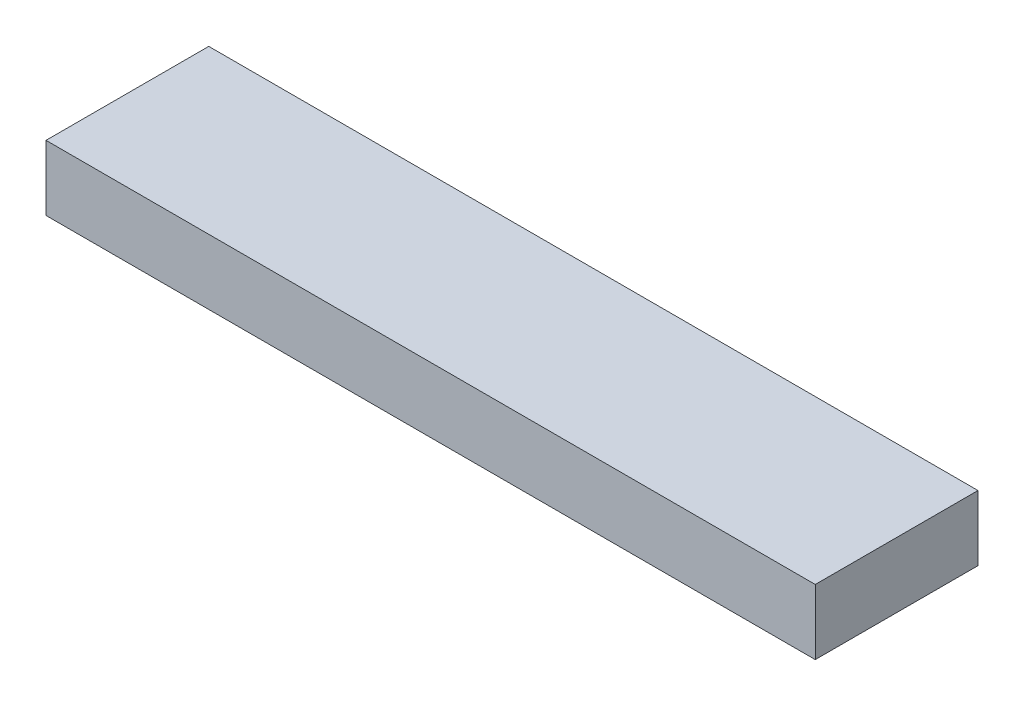
ISO-10303-21;
HEADER;
FILE_DESCRIPTION(('STEP AP214'),'2;1');
FILE_NAME('part.step','',(''),(''),'','','');
FILE_SCHEMA(('AUTOMOTIVE_DESIGN { 1 0 10303 214 1 1 1 1 }'));
ENDSEC;
DATA;
#1=APPLICATION_CONTEXT('core data for automotive mechanical design processes');
#2=APPLICATION_PROTOCOL_DEFINITION('international standard','automotive_design',2000,#1);
#3=PRODUCT_CONTEXT('',#1,'mechanical');
#4=PRODUCT('Part','Part','',(#3));
#5=PRODUCT_RELATED_PRODUCT_CATEGORY('part','',(#4));
#6=PRODUCT_DEFINITION_FORMATION('','',#4);
#7=PRODUCT_DEFINITION_CONTEXT('part definition',#1,'design');
#8=PRODUCT_DEFINITION('design','',#6,#7);
#9=PRODUCT_DEFINITION_SHAPE('','',#8);
#10=(LENGTH_UNIT() NAMED_UNIT(*) SI_UNIT(.MILLI.,.METRE.));
#11=(NAMED_UNIT(*) PLANE_ANGLE_UNIT() SI_UNIT($,.RADIAN.));
#12=(NAMED_UNIT(*) SI_UNIT($,.STERADIAN.) SOLID_ANGLE_UNIT());
#13=UNCERTAINTY_MEASURE_WITH_UNIT(LENGTH_MEASURE(1.E-05),#10,'distance_accuracy_value','');
#14=(GEOMETRIC_REPRESENTATION_CONTEXT(3) GLOBAL_UNCERTAINTY_ASSIGNED_CONTEXT((#13)) GLOBAL_UNIT_ASSIGNED_CONTEXT((#10,
#11,#12)) REPRESENTATION_CONTEXT('',''));
#15=CARTESIAN_POINT('',(0.,0.,0.));
#16=DIRECTION('',(0.,0.,1.));
#17=DIRECTION('',(1.,0.,0.));
#18=AXIS2_PLACEMENT_3D('',#15,#16,#17);
#19=CARTESIAN_POINT('',(0.,6.79999999999999,0.));
#20=DIRECTION('',(0.,-1.,0.));
#21=DIRECTION('',(0.,0.,-1.));
#22=AXIS2_PLACEMENT_3D('',#19,#20,#21);
#23=PLANE('',#22);
#24=DIRECTION('',(0.,0.,1.));
#25=VECTOR('',#24,1.);
#26=CARTESIAN_POINT('',(28.759347554151,6.8,11.7546737770755));
#27=LINE('',#26,#25);
#28=CARTESIAN_POINT('',(28.759347554151,6.8,4.25467377707552));
#29=VERTEX_POINT('',#28);
#30=CARTESIAN_POINT('',(28.759347554151,6.80000000000002,11.7546737770755));
#31=VERTEX_POINT('',#30);
#32=EDGE_CURVE('E55',#29,#31,#27,.T.);
#33=ORIENTED_EDGE('',*,*,#32,.T.);
#34=DIRECTION('',(1.,0.,0.));
#35=VECTOR('',#34,1.);
#36=CARTESIAN_POINT('',(-6.69065244584897,6.80000000000003,11.7546737770755));
#37=LINE('',#36,#35);
#38=CARTESIAN_POINT('',(-6.69065244584897,6.80000000000003,11.7546737770755));
#39=VERTEX_POINT('',#38);
#40=EDGE_CURVE('E76',#31,#39,#37,.F.);
#41=ORIENTED_EDGE('',*,*,#40,.T.);
#42=DIRECTION('',(0.,0.,-1.));
#43=VECTOR('',#42,1.);
#44=CARTESIAN_POINT('',(-6.69065244584897,6.80000000000003,11.7546737770755));
#45=LINE('',#44,#43);
#46=CARTESIAN_POINT('',(-6.69065244584897,6.80000000000001,4.25467377707552));
#47=VERTEX_POINT('',#46);
#48=EDGE_CURVE('E58',#39,#47,#45,.T.);
#49=ORIENTED_EDGE('',*,*,#48,.T.);
#50=DIRECTION('',(1.,0.,0.));
#51=VECTOR('',#50,1.);
#52=CARTESIAN_POINT('',(-6.69065244584897,6.8,4.25467377707552));
#53=LINE('',#52,#51);
#54=EDGE_CURVE('E20',#47,#29,#53,.T.);
#55=ORIENTED_EDGE('',*,*,#54,.T.);
#56=EDGE_LOOP('',(#33,#41,#49,#55));
#57=FACE_BOUND('',#56,.T.);
#58=ADVANCED_FACE('F17',(#57),#23,.T.);
#59=CARTESIAN_POINT('',(-6.69065244584897,9.8,4.25467377707551));
#60=DIRECTION('',(0.,0.,1.));
#61=DIRECTION('',(0.,-1.,0.));
#62=AXIS2_PLACEMENT_3D('',#59,#60,#61);
#63=PLANE('',#62);
#64=DIRECTION('',(0.,1.,0.));
#65=VECTOR('',#64,1.);
#66=CARTESIAN_POINT('',(-6.69065244584897,9.80000000000003,4.25467377707552));
#67=LINE('',#66,#65);
#68=CARTESIAN_POINT('',(-6.69065244584897,9.8,4.25467377707551));
#69=VERTEX_POINT('',#68);
#70=EDGE_CURVE('E78',#47,#69,#67,.T.);
#71=ORIENTED_EDGE('',*,*,#70,.T.);
#72=DIRECTION('',(1.,0.,0.));
#73=VECTOR('',#72,1.);
#74=CARTESIAN_POINT('',(0.,9.8,4.25467377707551));
#75=LINE('',#74,#73);
#76=CARTESIAN_POINT('',(28.759347554151,9.80000000000001,4.25467377707551));
#77=VERTEX_POINT('',#76);
#78=EDGE_CURVE('E73',#69,#77,#75,.T.);
#79=ORIENTED_EDGE('',*,*,#78,.T.);
#80=DIRECTION('',(0.,1.,0.));
#81=VECTOR('',#80,1.);
#82=CARTESIAN_POINT('',(28.759347554151,9.80000000000003,4.25467377707551));
#83=LINE('',#82,#81);
#84=EDGE_CURVE('E63',#77,#29,#83,.F.);
#85=ORIENTED_EDGE('',*,*,#84,.T.);
#86=ORIENTED_EDGE('',*,*,#54,.F.);
#87=EDGE_LOOP('',(#71,#79,#85,#86));
#88=FACE_BOUND('',#87,.T.);
#89=ADVANCED_FACE('F72',(#88),#63,.F.);
#90=CARTESIAN_POINT('',(28.759347554151,9.80000000000003,11.7546737770755));
#91=DIRECTION('',(-1.,0.,0.));
#92=DIRECTION('',(0.,0.,1.));
#93=AXIS2_PLACEMENT_3D('',#90,#91,#92);
#94=PLANE('',#93);
#95=ORIENTED_EDGE('',*,*,#84,.F.);
#96=DIRECTION('',(0.,0.,-1.));
#97=VECTOR('',#96,1.);
#98=CARTESIAN_POINT('',(28.759347554151,9.79999999999999,0.));
#99=LINE('',#98,#97);
#100=CARTESIAN_POINT('',(28.759347554151,9.80000000000003,11.7546737770755));
#101=VERTEX_POINT('',#100);
#102=EDGE_CURVE('E83',#77,#101,#99,.F.);
#103=ORIENTED_EDGE('',*,*,#102,.T.);
#104=DIRECTION('',(0.,1.,0.));
#105=VECTOR('',#104,1.);
#106=CARTESIAN_POINT('',(28.759347554151,9.80000000000003,11.7546737770755));
#107=LINE('',#106,#105);
#108=EDGE_CURVE('E69',#101,#31,#107,.F.);
#109=ORIENTED_EDGE('',*,*,#108,.T.);
#110=ORIENTED_EDGE('',*,*,#32,.F.);
#111=EDGE_LOOP('',(#95,#103,#109,#110));
#112=FACE_BOUND('',#111,.T.);
#113=ADVANCED_FACE('F66',(#112),#94,.F.);
#114=CARTESIAN_POINT('',(-6.69065244584897,9.80000000000003,11.7546737770755));
#115=DIRECTION('',(0.,0.,-1.));
#116=DIRECTION('',(0.,1.,0.));
#117=AXIS2_PLACEMENT_3D('',#114,#115,#116);
#118=PLANE('',#117);
#119=ORIENTED_EDGE('',*,*,#40,.F.);
#120=ORIENTED_EDGE('',*,*,#108,.F.);
#121=DIRECTION('',(1.,0.,0.));
#122=VECTOR('',#121,1.);
#123=CARTESIAN_POINT('',(0.,9.80000000000003,11.7546737770755));
#124=LINE('',#123,#122);
#125=CARTESIAN_POINT('',(-6.69065244584897,9.80000000000002,11.7546737770755));
#126=VERTEX_POINT('',#125);
#127=EDGE_CURVE('E26',#101,#126,#124,.F.);
#128=ORIENTED_EDGE('',*,*,#127,.T.);
#129=DIRECTION('',(0.,1.,0.));
#130=VECTOR('',#129,1.);
#131=CARTESIAN_POINT('',(-6.69065244584897,9.80000000000003,11.7546737770755));
#132=LINE('',#131,#130);
#133=EDGE_CURVE('E34',#126,#39,#132,.F.);
#134=ORIENTED_EDGE('',*,*,#133,.T.);
#135=EDGE_LOOP('',(#119,#120,#128,#134));
#136=FACE_BOUND('',#135,.T.);
#137=ADVANCED_FACE('F88',(#136),#118,.F.);
#138=CARTESIAN_POINT('',(-6.69065244584897,9.80000000000003,11.7546737770755));
#139=DIRECTION('',(1.,0.,0.));
#140=DIRECTION('',(0.,0.,-1.));
#141=AXIS2_PLACEMENT_3D('',#138,#139,#140);
#142=PLANE('',#141);
#143=ORIENTED_EDGE('',*,*,#133,.F.);
#144=DIRECTION('',(0.,0.,-1.));
#145=VECTOR('',#144,1.);
#146=CARTESIAN_POINT('',(-6.69065244584897,9.79999999999999,0.));
#147=LINE('',#146,#145);
#148=EDGE_CURVE('E11',#126,#69,#147,.T.);
#149=ORIENTED_EDGE('',*,*,#148,.T.);
#150=ORIENTED_EDGE('',*,*,#70,.F.);
#151=ORIENTED_EDGE('',*,*,#48,.F.);
#152=EDGE_LOOP('',(#143,#149,#150,#151));
#153=FACE_BOUND('',#152,.T.);
#154=ADVANCED_FACE('F91',(#153),#142,.F.);
#155=CARTESIAN_POINT('',(0.,9.79999999999999,0.));
#156=DIRECTION('',(0.,-1.,0.));
#157=DIRECTION('',(0.,0.,-1.));
#158=AXIS2_PLACEMENT_3D('',#155,#156,#157);
#159=PLANE('',#158);
#160=ORIENTED_EDGE('',*,*,#127,.F.);
#161=ORIENTED_EDGE('',*,*,#102,.F.);
#162=ORIENTED_EDGE('',*,*,#78,.F.);
#163=ORIENTED_EDGE('',*,*,#148,.F.);
#164=EDGE_LOOP('',(#160,#161,#162,#163));
#165=FACE_BOUND('',#164,.T.);
#166=ADVANCED_FACE('F90',(#165),#159,.F.);
#167=CLOSED_SHELL('',(#58,#89,#113,#137,#154,#166));
#168=MANIFOLD_SOLID_BREP('B1',#167);
#169=ADVANCED_BREP_SHAPE_REPRESENTATION('',(#18,#168),#14);
#170=SHAPE_DEFINITION_REPRESENTATION(#9,#169);
ENDSEC;
END-ISO-10303-21;
